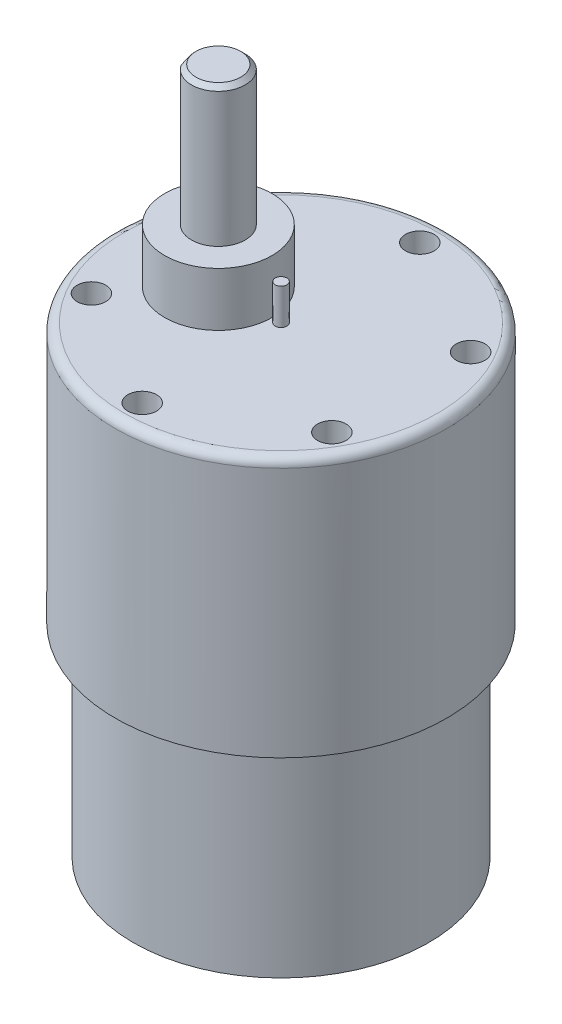
ISO-10303-21;
HEADER;
FILE_DESCRIPTION(('STEP AP214'),'2;1');
FILE_NAME('part.step','',(''),(''),'','','');
FILE_SCHEMA(('AUTOMOTIVE_DESIGN { 1 0 10303 214 1 1 1 1 }'));
ENDSEC;
DATA;
#1=APPLICATION_CONTEXT('core data for automotive mechanical design processes');
#2=APPLICATION_PROTOCOL_DEFINITION('international standard','automotive_design',2000,#1);
#3=PRODUCT_CONTEXT('',#1,'mechanical');
#4=PRODUCT('Part','Part','',(#3));
#5=PRODUCT_RELATED_PRODUCT_CATEGORY('part','',(#4));
#6=PRODUCT_DEFINITION_FORMATION('','',#4);
#7=PRODUCT_DEFINITION_CONTEXT('part definition',#1,'design');
#8=PRODUCT_DEFINITION('design','',#6,#7);
#9=PRODUCT_DEFINITION_SHAPE('','',#8);
#10=(LENGTH_UNIT() NAMED_UNIT(*) SI_UNIT(.MILLI.,.METRE.));
#11=(NAMED_UNIT(*) PLANE_ANGLE_UNIT() SI_UNIT($,.RADIAN.));
#12=(NAMED_UNIT(*) SI_UNIT($,.STERADIAN.) SOLID_ANGLE_UNIT());
#13=UNCERTAINTY_MEASURE_WITH_UNIT(LENGTH_MEASURE(1.E-05),#10,'distance_accuracy_value','');
#14=(GEOMETRIC_REPRESENTATION_CONTEXT(3) GLOBAL_UNCERTAINTY_ASSIGNED_CONTEXT((#13)) GLOBAL_UNIT_ASSIGNED_CONTEXT((#10,
#11,#12)) REPRESENTATION_CONTEXT('',''));
#15=CARTESIAN_POINT('',(0.,0.,0.));
#16=DIRECTION('',(0.,0.,1.));
#17=DIRECTION('',(1.,0.,0.));
#18=AXIS2_PLACEMENT_3D('',#15,#16,#17);
#19=CARTESIAN_POINT('',(0.,5.,0.));
#20=DIRECTION('',(0.,-1.,0.));
#21=DIRECTION('',(0.,0.,-1.));
#22=AXIS2_PLACEMENT_3D('',#19,#20,#21);
#23=CYLINDRICAL_SURFACE('',#22,7.5);
#24=CARTESIAN_POINT('',(0.,1.,0.));
#25=DIRECTION('',(0.,1.,0.));
#26=DIRECTION('',(0.,0.,1.));
#27=AXIS2_PLACEMENT_3D('',#24,#25,#26);
#28=CIRCLE('',#27,7.5);
#29=CARTESIAN_POINT('',(0.,1.,7.5));
#30=VERTEX_POINT('',#29);
#31=EDGE_CURVE('E61',#30,#30,#28,.T.);
#32=ORIENTED_EDGE('',*,*,#31,.T.);
#33=EDGE_LOOP('',(#32));
#34=FACE_BOUND('',#33,.T.);
#35=CARTESIAN_POINT('',(0.,5.,0.));
#36=DIRECTION('',(0.,1.,0.));
#37=DIRECTION('',(0.,0.,1.));
#38=AXIS2_PLACEMENT_3D('',#35,#36,#37);
#39=CIRCLE('',#38,7.5);
#40=CARTESIAN_POINT('',(0.,5.,7.5));
#41=VERTEX_POINT('',#40);
#42=EDGE_CURVE('E124',#41,#41,#39,.T.);
#43=ORIENTED_EDGE('',*,*,#42,.F.);
#44=EDGE_LOOP('',(#43));
#45=FACE_BOUND('',#44,.T.);
#46=ADVANCED_FACE('F52',(#34,#45),#23,.T.);
#47=CARTESIAN_POINT('',(0.,0.,0.));
#48=DIRECTION('',(0.,1.,0.));
#49=DIRECTION('',(0.,0.,1.));
#50=AXIS2_PLACEMENT_3D('',#47,#48,#49);
#51=PLANE('',#50);
#52=CARTESIAN_POINT('',(0.,0.,0.));
#53=DIRECTION('',(0.,1.,0.));
#54=DIRECTION('',(0.,0.,1.));
#55=AXIS2_PLACEMENT_3D('',#52,#53,#54);
#56=CIRCLE('',#55,6.5);
#57=CARTESIAN_POINT('',(0.,0.,6.5));
#58=VERTEX_POINT('',#57);
#59=EDGE_CURVE('E13',#58,#58,#56,.F.);
#60=ORIENTED_EDGE('',*,*,#59,.T.);
#61=EDGE_LOOP('',(#60));
#62=FACE_BOUND('',#61,.T.);
#63=ADVANCED_FACE('F289',(#62),#51,.F.);
#64=CARTESIAN_POINT('',(0.,27.7,0.));
#65=DIRECTION('',(0.,-1.,0.));
#66=DIRECTION('',(0.,0.,-1.));
#67=AXIS2_PLACEMENT_3D('',#64,#65,#66);
#68=CYLINDRICAL_SURFACE('',#67,16.5);
#69=CARTESIAN_POINT('',(0.,26.7,0.));
#70=DIRECTION('',(0.,1.,0.));
#71=DIRECTION('',(0.,0.,1.));
#72=AXIS2_PLACEMENT_3D('',#69,#70,#71);
#73=CIRCLE('',#72,16.5);
#74=CARTESIAN_POINT('',(0.,26.7,16.5));
#75=VERTEX_POINT('',#74);
#76=EDGE_CURVE('E306',#75,#75,#73,.F.);
#77=ORIENTED_EDGE('',*,*,#76,.T.);
#78=EDGE_LOOP('',(#77));
#79=FACE_BOUND('',#78,.T.);
#80=CARTESIAN_POINT('',(0.,5.,0.));
#81=DIRECTION('',(0.,1.,0.));
#82=DIRECTION('',(0.,0.,1.));
#83=AXIS2_PLACEMENT_3D('',#80,#81,#82);
#84=CIRCLE('',#83,16.5);
#85=CARTESIAN_POINT('',(0.,5.,16.5));
#86=VERTEX_POINT('',#85);
#87=EDGE_CURVE('E176',#86,#86,#84,.T.);
#88=ORIENTED_EDGE('',*,*,#87,.T.);
#89=EDGE_LOOP('',(#88));
#90=FACE_BOUND('',#89,.T.);
#91=ADVANCED_FACE('F285',(#79,#90),#68,.T.);
#92=CARTESIAN_POINT('',(0.,5.,0.));
#93=DIRECTION('',(0.,1.,0.));
#94=DIRECTION('',(0.,0.,1.));
#95=AXIS2_PLACEMENT_3D('',#92,#93,#94);
#96=PLANE('',#95);
#97=ORIENTED_EDGE('',*,*,#42,.T.);
#98=EDGE_LOOP('',(#97));
#99=FACE_BOUND('',#98,.T.);
#100=ORIENTED_EDGE('',*,*,#87,.F.);
#101=EDGE_LOOP('',(#100));
#102=FACE_BOUND('',#101,.T.);
#103=ADVANCED_FACE('F281',(#99,#102),#96,.F.);
#104=CARTESIAN_POINT('',(0.,56.7,0.));
#105=DIRECTION('',(0.,-1.,0.));
#106=DIRECTION('',(0.,0.,-1.));
#107=AXIS2_PLACEMENT_3D('',#104,#105,#106);
#108=CYLINDRICAL_SURFACE('',#107,18.5);
#109=CARTESIAN_POINT('',(0.,55.7,0.));
#110=DIRECTION('',(0.,1.,0.));
#111=DIRECTION('',(0.,0.,1.));
#112=AXIS2_PLACEMENT_3D('',#109,#110,#111);
#113=CIRCLE('',#112,18.5);
#114=CARTESIAN_POINT('',(0.,55.7,-18.5));
#115=VERTEX_POINT('',#114);
#116=EDGE_CURVE('E318',#115,#115,#113,.F.);
#117=CARTESIAN_POINT('',(0.,27.7,0.));
#118=DIRECTION('',(0.,1.,0.));
#119=DIRECTION('',(0.,0.,1.));
#120=AXIS2_PLACEMENT_3D('',#117,#118,#119);
#121=CIRCLE('',#120,18.5);
#122=CARTESIAN_POINT('',(0.,27.7,-18.5));
#123=VERTEX_POINT('',#122);
#124=EDGE_CURVE('E129',#123,#123,#121,.T.);
#125=CARTESIAN_POINT('',(0.,55.7,-18.5));
#126=CARTESIAN_POINT('',(0.,55.4083333333333,-18.5));
#127=CARTESIAN_POINT('',(0.,55.1166666666667,-18.5));
#128=CARTESIAN_POINT('',(0.,54.5333333333333,-18.5));
#129=CARTESIAN_POINT('',(0.,54.2416666666667,-18.5));
#130=CARTESIAN_POINT('',(0.,53.6583333333333,-18.5));
#131=CARTESIAN_POINT('',(0.,53.3666666666667,-18.5));
#132=CARTESIAN_POINT('',(0.,52.7833333333333,-18.5));
#133=CARTESIAN_POINT('',(0.,52.4916666666667,-18.5));
#134=CARTESIAN_POINT('',(0.,51.9083333333333,-18.5));
#135=CARTESIAN_POINT('',(0.,51.6166666666667,-18.5));
#136=CARTESIAN_POINT('',(0.,51.0333333333333,-18.5));
#137=CARTESIAN_POINT('',(0.,50.7416666666667,-18.5));
#138=CARTESIAN_POINT('',(0.,50.1583333333333,-18.5));
#139=CARTESIAN_POINT('',(0.,49.8666666666667,-18.5));
#140=CARTESIAN_POINT('',(0.,49.2833333333333,-18.5));
#141=CARTESIAN_POINT('',(0.,48.9916666666667,-18.5));
#142=CARTESIAN_POINT('',(0.,48.4083333333333,-18.5));
#143=CARTESIAN_POINT('',(0.,48.1166666666667,-18.5));
#144=CARTESIAN_POINT('',(0.,47.5333333333333,-18.5));
#145=CARTESIAN_POINT('',(0.,47.2416666666667,-18.5));
#146=CARTESIAN_POINT('',(0.,46.6583333333333,-18.5));
#147=CARTESIAN_POINT('',(0.,46.3666666666667,-18.5));
#148=CARTESIAN_POINT('',(0.,45.7833333333333,-18.5));
#149=CARTESIAN_POINT('',(0.,45.4916666666667,-18.5));
#150=CARTESIAN_POINT('',(0.,44.9083333333333,-18.5));
#151=CARTESIAN_POINT('',(0.,44.6166666666667,-18.5));
#152=CARTESIAN_POINT('',(0.,44.0333333333333,-18.5));
#153=CARTESIAN_POINT('',(0.,43.7416666666667,-18.5));
#154=CARTESIAN_POINT('',(0.,43.1583333333333,-18.5));
#155=CARTESIAN_POINT('',(0.,42.8666666666667,-18.5));
#156=CARTESIAN_POINT('',(0.,42.2833333333333,-18.5));
#157=CARTESIAN_POINT('',(0.,41.9916666666667,-18.5));
#158=CARTESIAN_POINT('',(0.,41.4083333333333,-18.5));
#159=CARTESIAN_POINT('',(0.,41.1166666666667,-18.5));
#160=CARTESIAN_POINT('',(0.,40.5333333333333,-18.5));
#161=CARTESIAN_POINT('',(0.,40.2416666666667,-18.5));
#162=CARTESIAN_POINT('',(0.,39.6583333333333,-18.5));
#163=CARTESIAN_POINT('',(0.,39.3666666666667,-18.5));
#164=CARTESIAN_POINT('',(0.,38.7833333333333,-18.5));
#165=CARTESIAN_POINT('',(0.,38.4916666666667,-18.5));
#166=CARTESIAN_POINT('',(0.,37.9083333333333,-18.5));
#167=CARTESIAN_POINT('',(0.,37.6166666666667,-18.5));
#168=CARTESIAN_POINT('',(0.,37.0333333333333,-18.5));
#169=CARTESIAN_POINT('',(0.,36.7416666666667,-18.5));
#170=CARTESIAN_POINT('',(0.,36.1583333333333,-18.5));
#171=CARTESIAN_POINT('',(0.,35.8666666666667,-18.5));
#172=CARTESIAN_POINT('',(0.,35.2833333333333,-18.5));
#173=CARTESIAN_POINT('',(0.,34.9916666666667,-18.5));
#174=CARTESIAN_POINT('',(0.,34.4083333333333,-18.5));
#175=CARTESIAN_POINT('',(0.,34.1166666666667,-18.5));
#176=CARTESIAN_POINT('',(0.,33.5333333333333,-18.5));
#177=CARTESIAN_POINT('',(0.,33.2416666666667,-18.5));
#178=CARTESIAN_POINT('',(0.,32.6583333333333,-18.5));
#179=CARTESIAN_POINT('',(0.,32.3666666666667,-18.5));
#180=CARTESIAN_POINT('',(0.,31.7833333333333,-18.5));
#181=CARTESIAN_POINT('',(0.,31.4916666666667,-18.5));
#182=CARTESIAN_POINT('',(0.,30.9083333333333,-18.5));
#183=CARTESIAN_POINT('',(0.,30.6166666666667,-18.5));
#184=CARTESIAN_POINT('',(0.,30.0333333333333,-18.5));
#185=CARTESIAN_POINT('',(0.,29.7416666666667,-18.5));
#186=CARTESIAN_POINT('',(0.,29.1583333333333,-18.5));
#187=CARTESIAN_POINT('',(0.,28.8666666666667,-18.5));
#188=CARTESIAN_POINT('',(0.,28.2833333333333,-18.5));
#189=CARTESIAN_POINT('',(0.,27.9916666666667,-18.5));
#190=CARTESIAN_POINT('',(0.,27.7,-18.5));
#191=B_SPLINE_CURVE_WITH_KNOTS('',3,(#125,#126,#127,#128,#129,#130,#131,#132,#133,#134,#135,
#136,#137,#138,#139,#140,#141,#142,#143,#144,#145,#146,#147,#148,#149,#150,#151,#152,#153,#154,
#155,#156,#157,#158,#159,#160,#161,#162,#163,#164,#165,#166,#167,#168,#169,#170,#171,#172,#173,
#174,#175,#176,#177,#178,#179,#180,#181,#182,#183,#184,#185,#186,#187,#188,#189,#190),
.UNSPECIFIED.,.F.,.F.,(4,2,2,2,2,2,2,2,2,2,2,2,2,2,2,2,2,2,2,2,2,2,2,2,2,2,2,2,2,2,2,2,4),(0.,
0.874999999999994,1.74999999999999,2.625,3.5,4.375,5.25,6.125,7.,7.87499999999999,
8.74999999999999,9.62499999999999,10.5,11.375,12.25,13.125,14.,14.875,15.75,16.625,17.5,18.375,
19.25,20.125,21.,21.875,22.75,23.625,24.5,25.375,26.25,27.125,28.),.UNSPECIFIED.);
#192=EDGE_CURVE('BSEAM274',#115,#123,#191,.T.);
#193=ORIENTED_EDGE('',*,*,#116,.T.);
#194=ORIENTED_EDGE('',*,*,#124,.T.);
#195=ORIENTED_EDGE('',*,*,#192,.T.);
#196=ORIENTED_EDGE('',*,*,#192,.F.);
#197=EDGE_LOOP('',(#193,#195,#194,#196));
#198=FACE_BOUND('',#197,.T.);
#199=ADVANCED_FACE('F274',(#198),#108,.T.);
#200=CARTESIAN_POINT('',(0.,56.7,0.));
#201=DIRECTION('',(0.,1.,0.));
#202=DIRECTION('',(0.,0.,1.));
#203=AXIS2_PLACEMENT_3D('',#200,#201,#202);
#204=PLANE('',#203);
#205=CARTESIAN_POINT('',(0.,56.7,0.));
#206=DIRECTION('',(0.,1.,0.));
#207=DIRECTION('',(0.,0.,1.));
#208=AXIS2_PLACEMENT_3D('',#205,#206,#207);
#209=CIRCLE('',#208,0.654296705717486);
#210=CARTESIAN_POINT('',(0.,56.7,0.654296705717486));
#211=VERTEX_POINT('',#210);
#212=EDGE_CURVE('E363',#211,#211,#209,.T.);
#213=ORIENTED_EDGE('',*,*,#212,.F.);
#214=EDGE_LOOP('',(#213));
#215=FACE_BOUND('',#214,.T.);
#216=CARTESIAN_POINT('',(0.,56.7,0.));
#217=DIRECTION('',(0.,1.,0.));
#218=DIRECTION('',(0.,0.,1.));
#219=AXIS2_PLACEMENT_3D('',#216,#217,#218);
#220=CIRCLE('',#219,17.5);
#221=CARTESIAN_POINT('',(0.,56.7,17.5));
#222=VERTEX_POINT('',#221);
#223=EDGE_CURVE('E322',#222,#222,#220,.T.);
#224=ORIENTED_EDGE('',*,*,#223,.T.);
#225=EDGE_LOOP('',(#224));
#226=FACE_BOUND('',#225,.T.);
#227=CARTESIAN_POINT('',(-7.,56.7,0.));
#228=DIRECTION('',(0.,1.,0.));
#229=DIRECTION('',(0.,0.,1.));
#230=AXIS2_PLACEMENT_3D('',#227,#228,#229);
#231=CIRCLE('',#230,6.);
#232=CARTESIAN_POINT('',(-7.,56.7,6.));
#233=VERTEX_POINT('',#232);
#234=EDGE_CURVE('E116',#233,#233,#231,.T.);
#235=ORIENTED_EDGE('',*,*,#234,.F.);
#236=EDGE_LOOP('',(#235));
#237=FACE_BOUND('',#236,.T.);
#238=CARTESIAN_POINT('',(0.,56.7,15.5));
#239=DIRECTION('',(0.,1.,0.));
#240=DIRECTION('',(0.,0.,1.));
#241=AXIS2_PLACEMENT_3D('',#238,#239,#240);
#242=CIRCLE('',#241,1.6);
#243=CARTESIAN_POINT('',(0.,56.7,17.1));
#244=VERTEX_POINT('',#243);
#245=EDGE_CURVE('E130',#244,#244,#242,.T.);
#246=ORIENTED_EDGE('',*,*,#245,.F.);
#247=EDGE_LOOP('',(#246));
#248=FACE_BOUND('',#247,.T.);
#249=CARTESIAN_POINT('',(13.4233937586587,56.7,7.75000000000016));
#250=DIRECTION('',(0.,1.,0.));
#251=DIRECTION('',(0.,0.,1.));
#252=AXIS2_PLACEMENT_3D('',#249,#250,#251);
#253=CIRCLE('',#252,1.6);
#254=CARTESIAN_POINT('',(13.4233937586587,56.7,9.35000000000016));
#255=VERTEX_POINT('',#254);
#256=EDGE_CURVE('E120',#255,#255,#253,.T.);
#257=ORIENTED_EDGE('',*,*,#256,.F.);
#258=EDGE_LOOP('',(#257));
#259=FACE_BOUND('',#258,.T.);
#260=CARTESIAN_POINT('',(13.4233937586589,56.7,-7.74999999999987));
#261=DIRECTION('',(0.,1.,0.));
#262=DIRECTION('',(0.,0.,1.));
#263=AXIS2_PLACEMENT_3D('',#260,#261,#262);
#264=CIRCLE('',#263,1.6);
#265=CARTESIAN_POINT('',(13.4233937586589,56.7,-6.14999999999988));
#266=VERTEX_POINT('',#265);
#267=EDGE_CURVE('E139',#266,#266,#264,.T.);
#268=ORIENTED_EDGE('',*,*,#267,.F.);
#269=EDGE_LOOP('',(#268));
#270=FACE_BOUND('',#269,.T.);
#271=CARTESIAN_POINT('',(1.08235921504137E-13,56.7,-15.5));
#272=DIRECTION('',(0.,1.,0.));
#273=DIRECTION('',(0.,0.,1.));
#274=AXIS2_PLACEMENT_3D('',#271,#272,#273);
#275=CIRCLE('',#274,1.6);
#276=CARTESIAN_POINT('',(1.08235921504137E-13,56.7,-13.9));
#277=VERTEX_POINT('',#276);
#278=EDGE_CURVE('E162',#277,#277,#275,.T.);
#279=ORIENTED_EDGE('',*,*,#278,.F.);
#280=EDGE_LOOP('',(#279));
#281=FACE_BOUND('',#280,.T.);
#282=CARTESIAN_POINT('',(-13.4233937586588,56.7,-7.75000000000006));
#283=DIRECTION('',(0.,1.,0.));
#284=DIRECTION('',(0.,0.,1.));
#285=AXIS2_PLACEMENT_3D('',#282,#283,#284);
#286=CIRCLE('',#285,1.6);
#287=CARTESIAN_POINT('',(-13.4233937586588,56.7,-6.15000000000006));
#288=VERTEX_POINT('',#287);
#289=EDGE_CURVE('E154',#288,#288,#286,.T.);
#290=ORIENTED_EDGE('',*,*,#289,.F.);
#291=EDGE_LOOP('',(#290));
#292=FACE_BOUND('',#291,.T.);
#293=CARTESIAN_POINT('',(-13.4233937586588,56.7,7.74999999999997));
#294=DIRECTION('',(0.,1.,0.));
#295=DIRECTION('',(0.,0.,1.));
#296=AXIS2_PLACEMENT_3D('',#293,#294,#295);
#297=CIRCLE('',#296,1.6);
#298=CARTESIAN_POINT('',(-13.4233937586588,56.7,9.34999999999997));
#299=VERTEX_POINT('',#298);
#300=EDGE_CURVE('E146',#299,#299,#297,.T.);
#301=ORIENTED_EDGE('',*,*,#300,.F.);
#302=EDGE_LOOP('',(#301));
#303=FACE_BOUND('',#302,.T.);
#304=ADVANCED_FACE('F271',(#215,#226,#237,#248,#259,#270,#281,#292,#303),#204,.T.);
#305=CARTESIAN_POINT('',(0.,27.7,0.));
#306=DIRECTION('',(0.,1.,0.));
#307=DIRECTION('',(0.,0.,1.));
#308=AXIS2_PLACEMENT_3D('',#305,#306,#307);
#309=PLANE('',#308);
#310=CARTESIAN_POINT('',(0.,27.7,0.));
#311=DIRECTION('',(0.,1.,0.));
#312=DIRECTION('',(0.,0.,1.));
#313=AXIS2_PLACEMENT_3D('',#310,#311,#312);
#314=CIRCLE('',#313,17.5);
#315=CARTESIAN_POINT('',(0.,27.7,17.5));
#316=VERTEX_POINT('',#315);
#317=EDGE_CURVE('E312',#316,#316,#314,.T.);
#318=ORIENTED_EDGE('',*,*,#317,.T.);
#319=EDGE_LOOP('',(#318));
#320=FACE_BOUND('',#319,.T.);
#321=ORIENTED_EDGE('',*,*,#124,.F.);
#322=EDGE_LOOP('',(#321));
#323=FACE_BOUND('',#322,.T.);
#324=ADVANCED_FACE('F247',(#320,#323),#309,.F.);
#325=CARTESIAN_POINT('',(-13.4233937586588,46.7,7.74999999999997));
#326=DIRECTION('',(0.,1.,0.));
#327=DIRECTION('',(0.,0.,1.));
#328=AXIS2_PLACEMENT_3D('',#325,#326,#327);
#329=CYLINDRICAL_SURFACE('',#328,1.6);
#330=CARTESIAN_POINT('',(-13.4233937586588,46.7,7.74999999999997));
#331=DIRECTION('',(0.,1.,0.));
#332=DIRECTION('',(0.,0.,1.));
#333=AXIS2_PLACEMENT_3D('',#330,#331,#332);
#334=CIRCLE('',#333,1.6);
#335=CARTESIAN_POINT('',(-13.4233937586588,46.7,9.34999999999997));
#336=VERTEX_POINT('',#335);
#337=EDGE_CURVE('E134',#336,#336,#334,.T.);
#338=ORIENTED_EDGE('',*,*,#337,.F.);
#339=EDGE_LOOP('',(#338));
#340=FACE_BOUND('',#339,.T.);
#341=ORIENTED_EDGE('',*,*,#300,.T.);
#342=EDGE_LOOP('',(#341));
#343=FACE_BOUND('',#342,.T.);
#344=ADVANCED_FACE('F243',(#340,#343),#329,.F.);
#345=CARTESIAN_POINT('',(-13.4233937586588,46.7,7.74999999999997));
#346=DIRECTION('',(0.,1.,0.));
#347=DIRECTION('',(0.,0.,1.));
#348=AXIS2_PLACEMENT_3D('',#345,#346,#347);
#349=PLANE('',#348);
#350=ORIENTED_EDGE('',*,*,#337,.T.);
#351=EDGE_LOOP('',(#350));
#352=FACE_BOUND('',#351,.T.);
#353=ADVANCED_FACE('F239',(#352),#349,.T.);
#354=CARTESIAN_POINT('',(-13.4233937586588,46.7,-7.75000000000006));
#355=DIRECTION('',(0.,1.,0.));
#356=DIRECTION('',(0.,0.,1.));
#357=AXIS2_PLACEMENT_3D('',#354,#355,#356);
#358=CYLINDRICAL_SURFACE('',#357,1.6);
#359=CARTESIAN_POINT('',(-13.4233937586588,46.7,-7.75000000000006));
#360=DIRECTION('',(0.,1.,0.));
#361=DIRECTION('',(0.,0.,1.));
#362=AXIS2_PLACEMENT_3D('',#359,#360,#361);
#363=CIRCLE('',#362,1.6);
#364=CARTESIAN_POINT('',(-13.4233937586588,46.7,-6.15000000000006));
#365=VERTEX_POINT('',#364);
#366=EDGE_CURVE('E150',#365,#365,#363,.T.);
#367=ORIENTED_EDGE('',*,*,#366,.F.);
#368=EDGE_LOOP('',(#367));
#369=FACE_BOUND('',#368,.T.);
#370=ORIENTED_EDGE('',*,*,#289,.T.);
#371=EDGE_LOOP('',(#370));
#372=FACE_BOUND('',#371,.T.);
#373=ADVANCED_FACE('F242',(#369,#372),#358,.F.);
#374=CARTESIAN_POINT('',(-13.4233937586588,46.7,-7.75000000000006));
#375=DIRECTION('',(0.,1.,0.));
#376=DIRECTION('',(0.,0.,1.));
#377=AXIS2_PLACEMENT_3D('',#374,#375,#376);
#378=PLANE('',#377);
#379=ORIENTED_EDGE('',*,*,#366,.T.);
#380=EDGE_LOOP('',(#379));
#381=FACE_BOUND('',#380,.T.);
#382=ADVANCED_FACE('F249',(#381),#378,.T.);
#383=CARTESIAN_POINT('',(1.08235921504137E-13,46.7,-15.5));
#384=DIRECTION('',(0.,1.,0.));
#385=DIRECTION('',(0.,0.,1.));
#386=AXIS2_PLACEMENT_3D('',#383,#384,#385);
#387=CYLINDRICAL_SURFACE('',#386,1.6);
#388=CARTESIAN_POINT('',(1.08235921504137E-13,46.7,-15.5));
#389=DIRECTION('',(0.,1.,0.));
#390=DIRECTION('',(0.,0.,1.));
#391=AXIS2_PLACEMENT_3D('',#388,#389,#390);
#392=CIRCLE('',#391,1.6);
#393=CARTESIAN_POINT('',(1.08235921504137E-13,46.7,-13.9));
#394=VERTEX_POINT('',#393);
#395=EDGE_CURVE('E158',#394,#394,#392,.T.);
#396=ORIENTED_EDGE('',*,*,#395,.F.);
#397=EDGE_LOOP('',(#396));
#398=FACE_BOUND('',#397,.T.);
#399=ORIENTED_EDGE('',*,*,#278,.T.);
#400=EDGE_LOOP('',(#399));
#401=FACE_BOUND('',#400,.T.);
#402=ADVANCED_FACE('F252',(#398,#401),#387,.F.);
#403=CARTESIAN_POINT('',(1.08235921504137E-13,46.7,-15.5));
#404=DIRECTION('',(0.,1.,0.));
#405=DIRECTION('',(0.,0.,1.));
#406=AXIS2_PLACEMENT_3D('',#403,#404,#405);
#407=PLANE('',#406);
#408=ORIENTED_EDGE('',*,*,#395,.T.);
#409=EDGE_LOOP('',(#408));
#410=FACE_BOUND('',#409,.T.);
#411=ADVANCED_FACE('F257',(#410),#407,.T.);
#412=CARTESIAN_POINT('',(13.4233937586589,46.7,-7.74999999999987));
#413=DIRECTION('',(0.,1.,0.));
#414=DIRECTION('',(0.,0.,1.));
#415=AXIS2_PLACEMENT_3D('',#412,#413,#414);
#416=CYLINDRICAL_SURFACE('',#415,1.6);
#417=CARTESIAN_POINT('',(13.4233937586589,46.7,-7.74999999999987));
#418=DIRECTION('',(0.,1.,0.));
#419=DIRECTION('',(0.,0.,1.));
#420=AXIS2_PLACEMENT_3D('',#417,#418,#419);
#421=CIRCLE('',#420,1.6);
#422=CARTESIAN_POINT('',(13.4233937586589,46.7,-6.14999999999988));
#423=VERTEX_POINT('',#422);
#424=EDGE_CURVE('E166',#423,#423,#421,.T.);
#425=ORIENTED_EDGE('',*,*,#424,.F.);
#426=EDGE_LOOP('',(#425));
#427=FACE_BOUND('',#426,.T.);
#428=ORIENTED_EDGE('',*,*,#267,.T.);
#429=EDGE_LOOP('',(#428));
#430=FACE_BOUND('',#429,.T.);
#431=ADVANCED_FACE('F260',(#427,#430),#416,.F.);
#432=CARTESIAN_POINT('',(13.4233937586589,46.7,-7.74999999999987));
#433=DIRECTION('',(0.,1.,0.));
#434=DIRECTION('',(0.,0.,1.));
#435=AXIS2_PLACEMENT_3D('',#432,#433,#434);
#436=PLANE('',#435);
#437=ORIENTED_EDGE('',*,*,#424,.T.);
#438=EDGE_LOOP('',(#437));
#439=FACE_BOUND('',#438,.T.);
#440=ADVANCED_FACE('F237',(#439),#436,.T.);
#441=CARTESIAN_POINT('',(13.4233937586587,46.7,7.75000000000016));
#442=DIRECTION('',(0.,1.,0.));
#443=DIRECTION('',(0.,0.,1.));
#444=AXIS2_PLACEMENT_3D('',#441,#442,#443);
#445=CYLINDRICAL_SURFACE('',#444,1.6);
#446=CARTESIAN_POINT('',(13.4233937586587,46.7,7.75000000000016));
#447=DIRECTION('',(0.,1.,0.));
#448=DIRECTION('',(0.,0.,1.));
#449=AXIS2_PLACEMENT_3D('',#446,#447,#448);
#450=CIRCLE('',#449,1.6);
#451=CARTESIAN_POINT('',(13.4233937586587,46.7,9.35000000000016));
#452=VERTEX_POINT('',#451);
#453=EDGE_CURVE('E135',#452,#452,#450,.T.);
#454=ORIENTED_EDGE('',*,*,#453,.F.);
#455=EDGE_LOOP('',(#454));
#456=FACE_BOUND('',#455,.T.);
#457=ORIENTED_EDGE('',*,*,#256,.T.);
#458=EDGE_LOOP('',(#457));
#459=FACE_BOUND('',#458,.T.);
#460=ADVANCED_FACE('F233',(#456,#459),#445,.F.);
#461=CARTESIAN_POINT('',(13.4233937586587,46.7,7.75000000000016));
#462=DIRECTION('',(0.,1.,0.));
#463=DIRECTION('',(0.,0.,1.));
#464=AXIS2_PLACEMENT_3D('',#461,#462,#463);
#465=PLANE('',#464);
#466=ORIENTED_EDGE('',*,*,#453,.T.);
#467=EDGE_LOOP('',(#466));
#468=FACE_BOUND('',#467,.T.);
#469=ADVANCED_FACE('F229',(#468),#465,.T.);
#470=CARTESIAN_POINT('',(0.,46.7,15.5));
#471=DIRECTION('',(0.,1.,0.));
#472=DIRECTION('',(0.,0.,1.));
#473=AXIS2_PLACEMENT_3D('',#470,#471,#472);
#474=CYLINDRICAL_SURFACE('',#473,1.6);
#475=CARTESIAN_POINT('',(0.,46.7,15.5));
#476=DIRECTION('',(0.,1.,0.));
#477=DIRECTION('',(0.,0.,1.));
#478=AXIS2_PLACEMENT_3D('',#475,#476,#477);
#479=CIRCLE('',#478,1.6);
#480=CARTESIAN_POINT('',(0.,46.7,17.1));
#481=VERTEX_POINT('',#480);
#482=EDGE_CURVE('E125',#481,#481,#479,.T.);
#483=ORIENTED_EDGE('',*,*,#482,.F.);
#484=EDGE_LOOP('',(#483));
#485=FACE_BOUND('',#484,.T.);
#486=ORIENTED_EDGE('',*,*,#245,.T.);
#487=EDGE_LOOP('',(#486));
#488=FACE_BOUND('',#487,.T.);
#489=ADVANCED_FACE('F225',(#485,#488),#474,.F.);
#490=CARTESIAN_POINT('',(0.,46.7,15.5));
#491=DIRECTION('',(0.,1.,0.));
#492=DIRECTION('',(0.,0.,1.));
#493=AXIS2_PLACEMENT_3D('',#490,#491,#492);
#494=PLANE('',#493);
#495=ORIENTED_EDGE('',*,*,#482,.T.);
#496=EDGE_LOOP('',(#495));
#497=FACE_BOUND('',#496,.T.);
#498=ADVANCED_FACE('F221',(#497),#494,.T.);
#499=CARTESIAN_POINT('',(-7.,62.7,0.));
#500=DIRECTION('',(0.,-1.,0.));
#501=DIRECTION('',(0.,0.,-1.));
#502=AXIS2_PLACEMENT_3D('',#499,#500,#501);
#503=CYLINDRICAL_SURFACE('',#502,6.);
#504=CARTESIAN_POINT('',(-7.,62.7,0.));
#505=DIRECTION('',(0.,1.,0.));
#506=DIRECTION('',(0.,0.,1.));
#507=AXIS2_PLACEMENT_3D('',#504,#505,#506);
#508=CIRCLE('',#507,6.);
#509=CARTESIAN_POINT('',(-7.,62.7,6.));
#510=VERTEX_POINT('',#509);
#511=EDGE_CURVE('E108',#510,#510,#508,.T.);
#512=ORIENTED_EDGE('',*,*,#511,.F.);
#513=EDGE_LOOP('',(#512));
#514=FACE_BOUND('',#513,.T.);
#515=ORIENTED_EDGE('',*,*,#234,.T.);
#516=EDGE_LOOP('',(#515));
#517=FACE_BOUND('',#516,.T.);
#518=ADVANCED_FACE('F217',(#514,#517),#503,.T.);
#519=CARTESIAN_POINT('',(-7.,62.7,0.));
#520=DIRECTION('',(0.,1.,0.));
#521=DIRECTION('',(0.,0.,1.));
#522=AXIS2_PLACEMENT_3D('',#519,#520,#521);
#523=PLANE('',#522);
#524=CARTESIAN_POINT('',(-7.,62.7,0.));
#525=DIRECTION('',(0.,1.,0.));
#526=DIRECTION('',(0.,0.,1.));
#527=AXIS2_PLACEMENT_3D('',#524,#525,#526);
#528=CIRCLE('',#527,3.);
#529=CARTESIAN_POINT('',(-7.,62.7,3.));
#530=VERTEX_POINT('',#529);
#531=EDGE_CURVE('E111',#530,#530,#528,.T.);
#532=ORIENTED_EDGE('',*,*,#531,.F.);
#533=EDGE_LOOP('',(#532));
#534=FACE_BOUND('',#533,.T.);
#535=ORIENTED_EDGE('',*,*,#511,.T.);
#536=EDGE_LOOP('',(#535));
#537=FACE_BOUND('',#536,.T.);
#538=ADVANCED_FACE('F214',(#534,#537),#523,.T.);
#539=CARTESIAN_POINT('',(-7.,78.2,0.));
#540=DIRECTION('',(0.,-1.,0.));
#541=DIRECTION('',(0.,0.,-1.));
#542=AXIS2_PLACEMENT_3D('',#539,#540,#541);
#543=CYLINDRICAL_SURFACE('',#542,3.);
#544=DIRECTION('',(0.,1.,0.));
#545=VECTOR('',#544,1.);
#546=CARTESIAN_POINT('',(-9.53332822879169,66.2,-1.60693748640298));
#547=LINE('',#546,#545);
#548=CARTESIAN_POINT('',(-9.53332822879169,66.2,-1.60693748640298));
#549=VERTEX_POINT('',#548);
#550=CARTESIAN_POINT('',(-9.53332822879169,77.7,-1.60693748640298));
#551=VERTEX_POINT('',#550);
#552=EDGE_CURVE('E96',#549,#551,#547,.T.);
#553=ORIENTED_EDGE('',*,*,#552,.T.);
#554=CARTESIAN_POINT('',(-7.,77.7,0.));
#555=DIRECTION('',(0.,1.,0.));
#556=DIRECTION('',(0.,0.,1.));
#557=AXIS2_PLACEMENT_3D('',#554,#555,#556);
#558=CIRCLE('',#557,3.);
#559=CARTESIAN_POINT('',(-9.46563006229553,77.7,1.70899631243153));
#560=VERTEX_POINT('',#559);
#561=EDGE_CURVE('E68',#551,#560,#558,.F.);
#562=ORIENTED_EDGE('',*,*,#561,.T.);
#563=DIRECTION('',(0.,1.,0.));
#564=VECTOR('',#563,1.);
#565=CARTESIAN_POINT('',(-9.46563006229553,66.2,1.70899631243153));
#566=LINE('',#565,#564);
#567=CARTESIAN_POINT('',(-9.46563006229553,66.2,1.70899631243153));
#568=VERTEX_POINT('',#567);
#569=EDGE_CURVE('E94',#568,#560,#566,.T.);
#570=ORIENTED_EDGE('',*,*,#569,.F.);
#571=CARTESIAN_POINT('',(-7.,66.2,0.));
#572=DIRECTION('',(0.,1.,0.));
#573=DIRECTION('',(0.,0.,1.));
#574=AXIS2_PLACEMENT_3D('',#571,#572,#573);
#575=CIRCLE('',#574,3.);
#576=EDGE_CURVE('E86',#549,#568,#575,.T.);
#577=ORIENTED_EDGE('',*,*,#576,.F.);
#578=EDGE_LOOP('',(#553,#562,#570,#577));
#579=FACE_BOUND('',#578,.T.);
#580=ORIENTED_EDGE('',*,*,#531,.T.);
#581=EDGE_LOOP('',(#580));
#582=FACE_BOUND('',#581,.T.);
#583=ADVANCED_FACE('F99',(#579,#582),#543,.T.);
#584=CARTESIAN_POINT('',(-7.,78.2,0.));
#585=DIRECTION('',(0.,1.,0.));
#586=DIRECTION('',(0.,0.,1.));
#587=AXIS2_PLACEMENT_3D('',#584,#585,#586);
#588=PLANE('',#587);
#589=CARTESIAN_POINT('',(-7.,78.2,0.));
#590=DIRECTION('',(0.,1.,0.));
#591=DIRECTION('',(0.,0.,1.));
#592=AXIS2_PLACEMENT_3D('',#589,#590,#591);
#593=CIRCLE('',#592,2.50000000000002);
#594=CARTESIAN_POINT('',(-9.49947914554361,78.2,0.0510294130142727));
#595=VERTEX_POINT('',#594);
#596=EDGE_CURVE('E115',#595,#595,#593,.T.);
#597=ORIENTED_EDGE('',*,*,#596,.T.);
#598=EDGE_LOOP('',(#597));
#599=FACE_BOUND('',#598,.T.);
#600=ADVANCED_FACE('F206',(#599),#588,.T.);
#601=CARTESIAN_POINT('',(-9.53332822879169,66.2,-1.60693748640298));
#602=DIRECTION('',(0.999791658217444,0.,-0.0204117652057092));
#603=DIRECTION('',(-0.0204117652057092,0.,-0.999791658217444));
#604=AXIS2_PLACEMENT_3D('',#601,#602,#603);
#605=PLANE('',#604);
#606=CARTESIAN_POINT('',(-9.46563006229553,77.7,1.70899631243153));
#607=CARTESIAN_POINT('',(-9.46655406625635,77.7250200255843,1.66373753922497));
#608=CARTESIAN_POINT('',(-9.46748415636743,77.749499427219,1.61818065940193));
#609=CARTESIAN_POINT('',(-9.46935722538555,77.7972096867305,1.52643559175566));
#610=CARTESIAN_POINT('',(-9.47030020048475,77.8204409038781,1.48024759044437));
#611=CARTESIAN_POINT('',(-9.47315880743271,77.8882337414681,1.34022974525138));
#612=CARTESIAN_POINT('',(-9.47509590047499,77.9306685534991,1.245348707509));
#613=CARTESIAN_POINT('',(-9.47897841919843,78.0071641313579,1.05517848982125));
#614=CARTESIAN_POINT('',(-9.48092223485983,78.0414185932365,0.959968170488548));
#615=CARTESIAN_POINT('',(-9.48486511778859,78.1011186383457,0.766841244826859));
#616=CARTESIAN_POINT('',(-9.48686414443217,78.1265705213043,0.668926628297436));
#617=CARTESIAN_POINT('',(-9.49061846907545,78.16395141614,0.48503550360721));
#618=CARTESIAN_POINT('',(-9.49236778591204,78.1772928993309,0.399351959671863));
#619=CARTESIAN_POINT('',(-9.49501496526718,78.1908266543301,0.269690080338714));
#620=CARTESIAN_POINT('',(-9.49590622372754,78.1942588205655,0.226035219281787));
#621=CARTESIAN_POINT('',(-9.49769131607615,78.1988484547413,0.138599349757379));
#622=CARTESIAN_POINT('',(-9.49858515036213,78.2000055502065,0.094818321808676));
#623=CARTESIAN_POINT('',(-9.49947914554361,78.2,0.0510294130142777));
#624=B_SPLINE_CURVE_WITH_KNOTS('',3,(#606,#607,#608,#609,#610,#611,#612,#613,#614,#615,#616,
#617,#618,#619,#620,#621,#622,#623),.UNSPECIFIED.,.F.,.F.,(4,2,2,2,2,2,2,2,4),(0.,
0.155160114661541,0.310275326953935,0.62188918746756,0.925164565305222,1.22822244720193,
1.48798349653101,1.61932602447731,1.75069005406606),.UNSPECIFIED.);
#625=EDGE_CURVE('E186',#560,#595,#624,.T.);
#626=ORIENTED_EDGE('',*,*,#625,.T.);
#627=CARTESIAN_POINT('',(-9.49947914554363,78.2,0.0510294130142733));
#628=CARTESIAN_POINT('',(-9.50104764353471,78.2000643176382,-0.0257974165920264));
#629=CARTESIAN_POINT('',(-9.50261534426428,78.1964585669139,-0.102585195415453));
#630=CARTESIAN_POINT('',(-9.50573508447061,78.1824138186157,-0.255393646946365));
#631=CARTESIAN_POINT('',(-9.50728714795841,78.1719877566791,-0.331415495742319));
#632=CARTESIAN_POINT('',(-9.51034292386579,78.1450231886172,-0.48109090258679));
#633=CARTESIAN_POINT('',(-9.51184701257742,78.1285851348585,-0.55476289185151));
#634=CARTESIAN_POINT('',(-9.51482669389578,78.0903277696489,-0.700711098497225));
#635=CARTESIAN_POINT('',(-9.51630227515037,78.0685063602177,-0.772986759837116));
#636=CARTESIAN_POINT('',(-9.51910222472895,78.0222417065684,-0.910131499838047));
#637=CARTESIAN_POINT('',(-9.52042910012572,77.9981581621013,-0.975123377797198));
#638=CARTESIAN_POINT('',(-9.52305586973116,77.9466971992364,-1.10378556419354));
#639=CARTESIAN_POINT('',(-9.52435576278243,77.9193196398837,-1.16745581593991));
#640=CARTESIAN_POINT('',(-9.52694957492076,77.8613450460912,-1.29450370781773));
#641=CARTESIAN_POINT('',(-9.52824308582376,77.8307045192354,-1.35786135462565));
#642=CARTESIAN_POINT('',(-9.53080428832251,77.767035036112,-1.48331198897535));
#643=CARTESIAN_POINT('',(-9.53207199763097,77.7340077944289,-1.54540584410637));
#644=CARTESIAN_POINT('',(-9.53332822879169,77.7,-1.60693748640298));
#645=B_SPLINE_CURVE_WITH_KNOTS('',3,(#627,#628,#629,#630,#631,#632,#633,#634,#635,#636,#637,
#638,#639,#640,#641,#642,#643,#644),.UNSPECIFIED.,.F.,.F.,(4,2,2,2,2,2,2,2,4),(0.,
0.230381722715163,0.460327757459292,0.686595219702815,0.912951001700745,1.12081935764499,
1.32869661170076,1.53981070703045,1.75077462023261),.UNSPECIFIED.);
#646=EDGE_CURVE('E76',#595,#551,#645,.T.);
#647=ORIENTED_EDGE('',*,*,#646,.T.);
#648=ORIENTED_EDGE('',*,*,#552,.F.);
#649=DIRECTION('',(-0.0204117652057092,0.,-0.999791658217444));
#650=VECTOR('',#649,1.);
#651=CARTESIAN_POINT('',(-9.53332822879169,66.2,-1.60693748640298));
#652=LINE('',#651,#650);
#653=EDGE_CURVE('E89',#568,#549,#652,.T.);
#654=ORIENTED_EDGE('',*,*,#653,.F.);
#655=ORIENTED_EDGE('',*,*,#569,.T.);
#656=EDGE_LOOP('',(#626,#647,#648,#654,#655));
#657=FACE_BOUND('',#656,.T.);
#658=ADVANCED_FACE('F93',(#657),#605,.F.);
#659=CARTESIAN_POINT('',(-7.,66.2,0.));
#660=DIRECTION('',(0.,1.,0.));
#661=DIRECTION('',(0.,0.,1.));
#662=AXIS2_PLACEMENT_3D('',#659,#660,#661);
#663=PLANE('',#662);
#664=ORIENTED_EDGE('',*,*,#576,.T.);
#665=ORIENTED_EDGE('',*,*,#653,.T.);
#666=EDGE_LOOP('',(#664,#665));
#667=FACE_BOUND('',#666,.T.);
#668=ADVANCED_FACE('F88',(#667),#663,.T.);
#669=CARTESIAN_POINT('',(-7.,78.2,0.));
#670=DIRECTION('',(0.,-1.,0.));
#671=DIRECTION('',(0.,0.,-1.));
#672=AXIS2_PLACEMENT_3D('',#669,#670,#671);
#673=CONICAL_SURFACE('',#672,2.50000000000002,0.785398163397441);
#674=ORIENTED_EDGE('',*,*,#625,.F.);
#675=ORIENTED_EDGE('',*,*,#561,.F.);
#676=ORIENTED_EDGE('',*,*,#646,.F.);
#677=ORIENTED_EDGE('',*,*,#596,.F.);
#678=EDGE_LOOP('',(#674,#675,#676,#677));
#679=FACE_BOUND('',#678,.T.);
#680=ADVANCED_FACE('F198',(#679),#673,.T.);
#681=CARTESIAN_POINT('',(0.,55.7,0.));
#682=DIRECTION('',(0.,1.,0.));
#683=DIRECTION('',(0.,0.,1.));
#684=AXIS2_PLACEMENT_3D('',#681,#682,#683);
#685=TOROIDAL_SURFACE('',#684,17.5,1.);
#686=ORIENTED_EDGE('',*,*,#116,.F.);
#687=EDGE_LOOP('',(#686));
#688=FACE_BOUND('',#687,.T.);
#689=ORIENTED_EDGE('',*,*,#223,.F.);
#690=EDGE_LOOP('',(#689));
#691=FACE_BOUND('',#690,.T.);
#692=ADVANCED_FACE('F397',(#688,#691),#685,.T.);
#693=CARTESIAN_POINT('',(0.,26.7,0.));
#694=DIRECTION('',(0.,1.,0.));
#695=DIRECTION('',(0.,0.,1.));
#696=AXIS2_PLACEMENT_3D('',#693,#694,#695);
#697=TOROIDAL_SURFACE('',#696,17.5,1.);
#698=ORIENTED_EDGE('',*,*,#76,.F.);
#699=EDGE_LOOP('',(#698));
#700=FACE_BOUND('',#699,.T.);
#701=ORIENTED_EDGE('',*,*,#317,.F.);
#702=EDGE_LOOP('',(#701));
#703=FACE_BOUND('',#702,.T.);
#704=ADVANCED_FACE('F399',(#700,#703),#697,.F.);
#705=CARTESIAN_POINT('',(0.,1.,0.));
#706=DIRECTION('',(0.,1.,0.));
#707=DIRECTION('',(0.,0.,1.));
#708=AXIS2_PLACEMENT_3D('',#705,#706,#707);
#709=TOROIDAL_SURFACE('',#708,6.5,1.);
#710=ORIENTED_EDGE('',*,*,#59,.F.);
#711=EDGE_LOOP('',(#710));
#712=FACE_BOUND('',#711,.T.);
#713=ORIENTED_EDGE('',*,*,#31,.F.);
#714=EDGE_LOOP('',(#713));
#715=FACE_BOUND('',#714,.T.);
#716=ADVANCED_FACE('F54',(#712,#715),#709,.T.);
#717=CARTESIAN_POINT('',(0.,60.7,0.));
#718=DIRECTION('',(0.,-1.,0.));
#719=DIRECTION('',(0.,0.,-1.));
#720=AXIS2_PLACEMENT_3D('',#717,#718,#719);
#721=CYLINDRICAL_SURFACE('',#720,0.654296705717486);
#722=CARTESIAN_POINT('',(0.,60.7,0.));
#723=DIRECTION('',(0.,1.,0.));
#724=DIRECTION('',(0.,0.,1.));
#725=AXIS2_PLACEMENT_3D('',#722,#723,#724);
#726=CIRCLE('',#725,0.654296705717486);
#727=CARTESIAN_POINT('',(0.,60.7,0.654296705717486));
#728=VERTEX_POINT('',#727);
#729=EDGE_CURVE('E91',#728,#728,#726,.T.);
#730=ORIENTED_EDGE('',*,*,#729,.F.);
#731=EDGE_LOOP('',(#730));
#732=FACE_BOUND('',#731,.T.);
#733=ORIENTED_EDGE('',*,*,#212,.T.);
#734=EDGE_LOOP('',(#733));
#735=FACE_BOUND('',#734,.T.);
#736=ADVANCED_FACE('F372',(#732,#735),#721,.T.);
#737=CARTESIAN_POINT('',(0.,60.7,0.));
#738=DIRECTION('',(0.,1.,0.));
#739=DIRECTION('',(0.,0.,1.));
#740=AXIS2_PLACEMENT_3D('',#737,#738,#739);
#741=PLANE('',#740);
#742=ORIENTED_EDGE('',*,*,#729,.T.);
#743=EDGE_LOOP('',(#742));
#744=FACE_BOUND('',#743,.T.);
#745=ADVANCED_FACE('F502',(#744),#741,.T.);
#746=CLOSED_SHELL('',(#46,#63,#91,#103,#199,#304,#324,#344,#353,#373,#382,#402,#411,#431,#440,
#460,#469,#489,#498,#518,#538,#583,#600,#658,#668,#680,#692,#704,#716,#736,#745));
#747=MANIFOLD_SOLID_BREP('B2',#746);
#748=ADVANCED_BREP_SHAPE_REPRESENTATION('',(#18,#747),#14);
#749=SHAPE_DEFINITION_REPRESENTATION(#9,#748);
ENDSEC;
END-ISO-10303-21;
